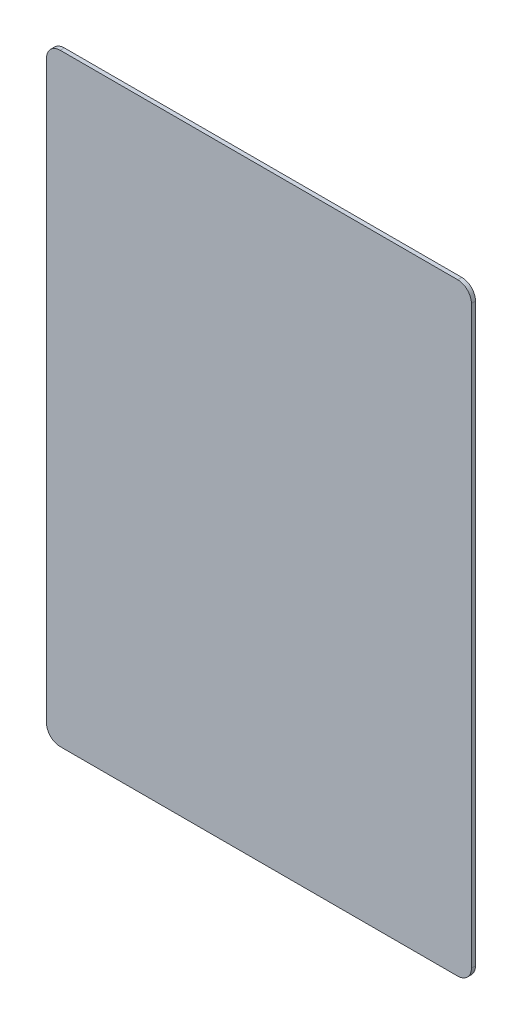
ISO-10303-21;
HEADER;
FILE_DESCRIPTION(('STEP AP214'),'2;1');
FILE_NAME('part.step','',(''),(''),'','','');
FILE_SCHEMA(('AUTOMOTIVE_DESIGN { 1 0 10303 214 1 1 1 1 }'));
ENDSEC;
DATA;
#1=APPLICATION_CONTEXT('core data for automotive mechanical design processes');
#2=APPLICATION_PROTOCOL_DEFINITION('international standard','automotive_design',2000,#1);
#3=PRODUCT_CONTEXT('',#1,'mechanical');
#4=PRODUCT('Part','Part','',(#3));
#5=PRODUCT_RELATED_PRODUCT_CATEGORY('part','',(#4));
#6=PRODUCT_DEFINITION_FORMATION('','',#4);
#7=PRODUCT_DEFINITION_CONTEXT('part definition',#1,'design');
#8=PRODUCT_DEFINITION('design','',#6,#7);
#9=PRODUCT_DEFINITION_SHAPE('','',#8);
#10=(LENGTH_UNIT() NAMED_UNIT(*) SI_UNIT(.MILLI.,.METRE.));
#11=(NAMED_UNIT(*) PLANE_ANGLE_UNIT() SI_UNIT($,.RADIAN.));
#12=(NAMED_UNIT(*) SI_UNIT($,.STERADIAN.) SOLID_ANGLE_UNIT());
#13=UNCERTAINTY_MEASURE_WITH_UNIT(LENGTH_MEASURE(1.E-05),#10,'distance_accuracy_value','');
#14=(GEOMETRIC_REPRESENTATION_CONTEXT(3) GLOBAL_UNCERTAINTY_ASSIGNED_CONTEXT((#13)) GLOBAL_UNIT_ASSIGNED_CONTEXT((#10,
#11,#12)) REPRESENTATION_CONTEXT('',''));
#15=CARTESIAN_POINT('',(0.,0.,0.));
#16=DIRECTION('',(0.,0.,1.));
#17=DIRECTION('',(1.,0.,0.));
#18=AXIS2_PLACEMENT_3D('',#15,#16,#17);
#19=CARTESIAN_POINT('',(0.,440.,3.));
#20=DIRECTION('',(0.,1.,0.));
#21=DIRECTION('',(0.,0.,1.));
#22=AXIS2_PLACEMENT_3D('',#19,#20,#21);
#23=PLANE('',#22);
#24=DIRECTION('',(1.,0.,0.));
#25=VECTOR('',#24,1.);
#26=CARTESIAN_POINT('',(0.,440.,3.));
#27=LINE('',#26,#25);
#28=CARTESIAN_POINT('',(10.,440.,3.));
#29=VERTEX_POINT('',#28);
#30=CARTESIAN_POINT('',(300.,440.,3.));
#31=VERTEX_POINT('',#30);
#32=EDGE_CURVE('E139',#29,#31,#27,.T.);
#33=ORIENTED_EDGE('',*,*,#32,.T.);
#34=DIRECTION('',(0.,0.,-1.));
#35=VECTOR('',#34,1.);
#36=CARTESIAN_POINT('',(300.,440.,0.));
#37=LINE('',#36,#35);
#38=CARTESIAN_POINT('',(300.,440.,0.));
#39=VERTEX_POINT('',#38);
#40=EDGE_CURVE('E11',#31,#39,#37,.T.);
#41=ORIENTED_EDGE('',*,*,#40,.T.);
#42=DIRECTION('',(1.,0.,0.));
#43=VECTOR('',#42,1.);
#44=CARTESIAN_POINT('',(0.,440.,0.));
#45=LINE('',#44,#43);
#46=CARTESIAN_POINT('',(10.,440.,0.));
#47=VERTEX_POINT('',#46);
#48=EDGE_CURVE('E130',#47,#39,#45,.T.);
#49=ORIENTED_EDGE('',*,*,#48,.F.);
#50=DIRECTION('',(0.,0.,-1.));
#51=VECTOR('',#50,1.);
#52=CARTESIAN_POINT('',(10.,440.,3.));
#53=LINE('',#52,#51);
#54=EDGE_CURVE('E43',#47,#29,#53,.F.);
#55=ORIENTED_EDGE('',*,*,#54,.T.);
#56=EDGE_LOOP('',(#33,#41,#49,#55));
#57=FACE_BOUND('',#56,.T.);
#58=ADVANCED_FACE('F35',(#57),#23,.T.);
#59=CARTESIAN_POINT('',(0.,0.,3.));
#60=DIRECTION('',(-1.,0.,0.));
#61=DIRECTION('',(0.,0.,1.));
#62=AXIS2_PLACEMENT_3D('',#59,#60,#61);
#63=PLANE('',#62);
#64=DIRECTION('',(0.,1.,0.));
#65=VECTOR('',#64,1.);
#66=CARTESIAN_POINT('',(0.,0.,0.));
#67=LINE('',#66,#65);
#68=CARTESIAN_POINT('',(0.,10.,0.));
#69=VERTEX_POINT('',#68);
#70=CARTESIAN_POINT('',(0.,430.,0.));
#71=VERTEX_POINT('',#70);
#72=EDGE_CURVE('E132',#69,#71,#67,.T.);
#73=ORIENTED_EDGE('',*,*,#72,.F.);
#74=DIRECTION('',(0.,0.,-1.));
#75=VECTOR('',#74,1.);
#76=CARTESIAN_POINT('',(0.,10.,3.));
#77=LINE('',#76,#75);
#78=CARTESIAN_POINT('',(0.,10.,3.));
#79=VERTEX_POINT('',#78);
#80=EDGE_CURVE('E57',#69,#79,#77,.F.);
#81=ORIENTED_EDGE('',*,*,#80,.T.);
#82=DIRECTION('',(0.,1.,0.));
#83=VECTOR('',#82,1.);
#84=CARTESIAN_POINT('',(0.,0.,3.));
#85=LINE('',#84,#83);
#86=CARTESIAN_POINT('',(0.,430.,3.));
#87=VERTEX_POINT('',#86);
#88=EDGE_CURVE('E140',#79,#87,#85,.T.);
#89=ORIENTED_EDGE('',*,*,#88,.T.);
#90=DIRECTION('',(0.,0.,-1.));
#91=VECTOR('',#90,1.);
#92=CARTESIAN_POINT('',(0.,430.,3.));
#93=LINE('',#92,#91);
#94=EDGE_CURVE('E155',#87,#71,#93,.T.);
#95=ORIENTED_EDGE('',*,*,#94,.T.);
#96=EDGE_LOOP('',(#73,#81,#89,#95));
#97=FACE_BOUND('',#96,.T.);
#98=ADVANCED_FACE('F169',(#97),#63,.T.);
#99=CARTESIAN_POINT('',(0.,0.,3.));
#100=DIRECTION('',(0.,1.,0.));
#101=DIRECTION('',(0.,0.,1.));
#102=AXIS2_PLACEMENT_3D('',#99,#100,#101);
#103=PLANE('',#102);
#104=DIRECTION('',(1.,0.,0.));
#105=VECTOR('',#104,1.);
#106=CARTESIAN_POINT('',(0.,0.,0.));
#107=LINE('',#106,#105);
#108=CARTESIAN_POINT('',(10.,0.,0.));
#109=VERTEX_POINT('',#108);
#110=CARTESIAN_POINT('',(300.,0.,0.));
#111=VERTEX_POINT('',#110);
#112=EDGE_CURVE('E129',#109,#111,#107,.T.);
#113=ORIENTED_EDGE('',*,*,#112,.T.);
#114=DIRECTION('',(0.,0.,-1.));
#115=VECTOR('',#114,1.);
#116=CARTESIAN_POINT('',(300.,0.,3.));
#117=LINE('',#116,#115);
#118=CARTESIAN_POINT('',(300.,0.,3.));
#119=VERTEX_POINT('',#118);
#120=EDGE_CURVE('E107',#111,#119,#117,.F.);
#121=ORIENTED_EDGE('',*,*,#120,.T.);
#122=DIRECTION('',(1.,0.,0.));
#123=VECTOR('',#122,1.);
#124=CARTESIAN_POINT('',(0.,0.,3.));
#125=LINE('',#124,#123);
#126=CARTESIAN_POINT('',(10.,0.,3.));
#127=VERTEX_POINT('',#126);
#128=EDGE_CURVE('E177',#127,#119,#125,.T.);
#129=ORIENTED_EDGE('',*,*,#128,.F.);
#130=DIRECTION('',(0.,0.,-1.));
#131=VECTOR('',#130,1.);
#132=CARTESIAN_POINT('',(10.,0.,0.));
#133=LINE('',#132,#131);
#134=EDGE_CURVE('E112',#127,#109,#133,.T.);
#135=ORIENTED_EDGE('',*,*,#134,.T.);
#136=EDGE_LOOP('',(#113,#121,#129,#135));
#137=FACE_BOUND('',#136,.T.);
#138=ADVANCED_FACE('F176',(#137),#103,.F.);
#139=CARTESIAN_POINT('',(310.,0.,3.));
#140=DIRECTION('',(-1.,0.,0.));
#141=DIRECTION('',(0.,0.,1.));
#142=AXIS2_PLACEMENT_3D('',#139,#140,#141);
#143=PLANE('',#142);
#144=DIRECTION('',(0.,1.,0.));
#145=VECTOR('',#144,1.);
#146=CARTESIAN_POINT('',(310.,0.,3.));
#147=LINE('',#146,#145);
#148=CARTESIAN_POINT('',(310.,10.,3.));
#149=VERTEX_POINT('',#148);
#150=CARTESIAN_POINT('',(310.,430.,3.));
#151=VERTEX_POINT('',#150);
#152=EDGE_CURVE('E122',#149,#151,#147,.T.);
#153=ORIENTED_EDGE('',*,*,#152,.F.);
#154=DIRECTION('',(0.,0.,-1.));
#155=VECTOR('',#154,1.);
#156=CARTESIAN_POINT('',(310.,10.,3.));
#157=LINE('',#156,#155);
#158=CARTESIAN_POINT('',(310.,10.,0.));
#159=VERTEX_POINT('',#158);
#160=EDGE_CURVE('E106',#149,#159,#157,.T.);
#161=ORIENTED_EDGE('',*,*,#160,.T.);
#162=DIRECTION('',(0.,1.,0.));
#163=VECTOR('',#162,1.);
#164=CARTESIAN_POINT('',(310.,0.,0.));
#165=LINE('',#164,#163);
#166=CARTESIAN_POINT('',(310.,430.,0.));
#167=VERTEX_POINT('',#166);
#168=EDGE_CURVE('E119',#159,#167,#165,.T.);
#169=ORIENTED_EDGE('',*,*,#168,.T.);
#170=DIRECTION('',(0.,0.,-1.));
#171=VECTOR('',#170,1.);
#172=CARTESIAN_POINT('',(310.,430.,3.));
#173=LINE('',#172,#171);
#174=EDGE_CURVE('E124',#167,#151,#173,.F.);
#175=ORIENTED_EDGE('',*,*,#174,.T.);
#176=EDGE_LOOP('',(#153,#161,#169,#175));
#177=FACE_BOUND('',#176,.T.);
#178=ADVANCED_FACE('F118',(#177),#143,.F.);
#179=CARTESIAN_POINT('',(0.,0.,3.));
#180=DIRECTION('',(0.,0.,1.));
#181=DIRECTION('',(1.,0.,0.));
#182=AXIS2_PLACEMENT_3D('',#179,#180,#181);
#183=PLANE('',#182);
#184=ORIENTED_EDGE('',*,*,#128,.T.);
#185=CARTESIAN_POINT('',(300.,10.,3.));
#186=DIRECTION('',(0.,0.,1.));
#187=DIRECTION('',(1.,0.,0.));
#188=AXIS2_PLACEMENT_3D('',#185,#186,#187);
#189=CIRCLE('',#188,10.);
#190=EDGE_CURVE('E153',#119,#149,#189,.T.);
#191=ORIENTED_EDGE('',*,*,#190,.T.);
#192=ORIENTED_EDGE('',*,*,#152,.T.);
#193=CARTESIAN_POINT('',(300.,430.,3.));
#194=DIRECTION('',(0.,0.,1.));
#195=DIRECTION('',(1.,0.,0.));
#196=AXIS2_PLACEMENT_3D('',#193,#194,#195);
#197=CIRCLE('',#196,10.);
#198=EDGE_CURVE('E149',#151,#31,#197,.T.);
#199=ORIENTED_EDGE('',*,*,#198,.T.);
#200=ORIENTED_EDGE('',*,*,#32,.F.);
#201=CARTESIAN_POINT('',(10.,430.,3.));
#202=DIRECTION('',(0.,0.,1.));
#203=DIRECTION('',(1.,0.,0.));
#204=AXIS2_PLACEMENT_3D('',#201,#202,#203);
#205=CIRCLE('',#204,10.);
#206=EDGE_CURVE('E50',#29,#87,#205,.T.);
#207=ORIENTED_EDGE('',*,*,#206,.T.);
#208=ORIENTED_EDGE('',*,*,#88,.F.);
#209=CARTESIAN_POINT('',(10.,10.,3.));
#210=DIRECTION('',(0.,0.,1.));
#211=DIRECTION('',(1.,0.,0.));
#212=AXIS2_PLACEMENT_3D('',#209,#210,#211);
#213=CIRCLE('',#212,10.);
#214=EDGE_CURVE('E151',#79,#127,#213,.T.);
#215=ORIENTED_EDGE('',*,*,#214,.T.);
#216=EDGE_LOOP('',(#184,#191,#192,#199,#200,#207,#208,#215));
#217=FACE_BOUND('',#216,.T.);
#218=ADVANCED_FACE('F165',(#217),#183,.T.);
#219=CARTESIAN_POINT('',(0.,0.,0.));
#220=DIRECTION('',(0.,0.,1.));
#221=DIRECTION('',(1.,0.,0.));
#222=AXIS2_PLACEMENT_3D('',#219,#220,#221);
#223=PLANE('',#222);
#224=ORIENTED_EDGE('',*,*,#168,.F.);
#225=CARTESIAN_POINT('',(300.,10.,0.));
#226=DIRECTION('',(0.,0.,1.));
#227=DIRECTION('',(1.,0.,0.));
#228=AXIS2_PLACEMENT_3D('',#225,#226,#227);
#229=CIRCLE('',#228,10.);
#230=EDGE_CURVE('E102',#159,#111,#229,.F.);
#231=ORIENTED_EDGE('',*,*,#230,.T.);
#232=ORIENTED_EDGE('',*,*,#112,.F.);
#233=CARTESIAN_POINT('',(10.,10.,0.));
#234=DIRECTION('',(0.,0.,1.));
#235=DIRECTION('',(1.,0.,0.));
#236=AXIS2_PLACEMENT_3D('',#233,#234,#235);
#237=CIRCLE('',#236,10.);
#238=EDGE_CURVE('E113',#109,#69,#237,.F.);
#239=ORIENTED_EDGE('',*,*,#238,.T.);
#240=ORIENTED_EDGE('',*,*,#72,.T.);
#241=CARTESIAN_POINT('',(10.,430.,0.));
#242=DIRECTION('',(0.,0.,1.));
#243=DIRECTION('',(1.,0.,0.));
#244=AXIS2_PLACEMENT_3D('',#241,#242,#243);
#245=CIRCLE('',#244,10.);
#246=EDGE_CURVE('E123',#71,#47,#245,.F.);
#247=ORIENTED_EDGE('',*,*,#246,.T.);
#248=ORIENTED_EDGE('',*,*,#48,.T.);
#249=CARTESIAN_POINT('',(300.,430.,0.));
#250=DIRECTION('',(0.,0.,1.));
#251=DIRECTION('',(1.,0.,0.));
#252=AXIS2_PLACEMENT_3D('',#249,#250,#251);
#253=CIRCLE('',#252,10.);
#254=EDGE_CURVE('E128',#39,#167,#253,.F.);
#255=ORIENTED_EDGE('',*,*,#254,.T.);
#256=EDGE_LOOP('',(#224,#231,#232,#239,#240,#247,#248,#255));
#257=FACE_BOUND('',#256,.T.);
#258=ADVANCED_FACE('F126',(#257),#223,.F.);
#259=CARTESIAN_POINT('',(300.,10.,3.));
#260=DIRECTION('',(0.,0.,-1.));
#261=DIRECTION('',(-1.,0.,0.));
#262=AXIS2_PLACEMENT_3D('',#259,#260,#261);
#263=CYLINDRICAL_SURFACE('',#262,10.);
#264=ORIENTED_EDGE('',*,*,#190,.F.);
#265=ORIENTED_EDGE('',*,*,#120,.F.);
#266=ORIENTED_EDGE('',*,*,#230,.F.);
#267=ORIENTED_EDGE('',*,*,#160,.F.);
#268=EDGE_LOOP('',(#264,#265,#266,#267));
#269=FACE_BOUND('',#268,.T.);
#270=ADVANCED_FACE('F105',(#269),#263,.T.);
#271=CARTESIAN_POINT('',(10.,10.,3.));
#272=DIRECTION('',(0.,0.,1.));
#273=DIRECTION('',(1.,0.,0.));
#274=AXIS2_PLACEMENT_3D('',#271,#272,#273);
#275=CYLINDRICAL_SURFACE('',#274,10.);
#276=ORIENTED_EDGE('',*,*,#214,.F.);
#277=ORIENTED_EDGE('',*,*,#80,.F.);
#278=ORIENTED_EDGE('',*,*,#238,.F.);
#279=ORIENTED_EDGE('',*,*,#134,.F.);
#280=EDGE_LOOP('',(#276,#277,#278,#279));
#281=FACE_BOUND('',#280,.T.);
#282=ADVANCED_FACE('F173',(#281),#275,.T.);
#283=CARTESIAN_POINT('',(300.,430.,3.));
#284=DIRECTION('',(0.,0.,1.));
#285=DIRECTION('',(1.,0.,0.));
#286=AXIS2_PLACEMENT_3D('',#283,#284,#285);
#287=CYLINDRICAL_SURFACE('',#286,10.);
#288=ORIENTED_EDGE('',*,*,#198,.F.);
#289=ORIENTED_EDGE('',*,*,#174,.F.);
#290=ORIENTED_EDGE('',*,*,#254,.F.);
#291=ORIENTED_EDGE('',*,*,#40,.F.);
#292=EDGE_LOOP('',(#288,#289,#290,#291));
#293=FACE_BOUND('',#292,.T.);
#294=ADVANCED_FACE('F181',(#293),#287,.T.);
#295=CARTESIAN_POINT('',(10.,430.,3.));
#296=DIRECTION('',(0.,0.,-1.));
#297=DIRECTION('',(-1.,0.,0.));
#298=AXIS2_PLACEMENT_3D('',#295,#296,#297);
#299=CYLINDRICAL_SURFACE('',#298,10.);
#300=ORIENTED_EDGE('',*,*,#206,.F.);
#301=ORIENTED_EDGE('',*,*,#54,.F.);
#302=ORIENTED_EDGE('',*,*,#246,.F.);
#303=ORIENTED_EDGE('',*,*,#94,.F.);
#304=EDGE_LOOP('',(#300,#301,#302,#303));
#305=FACE_BOUND('',#304,.T.);
#306=ADVANCED_FACE('F37',(#305),#299,.T.);
#307=CLOSED_SHELL('',(#58,#98,#138,#178,#218,#258,#270,#282,#294,#306));
#308=MANIFOLD_SOLID_BREP('B2',#307);
#309=ADVANCED_BREP_SHAPE_REPRESENTATION('',(#18,#308),#14);
#310=SHAPE_DEFINITION_REPRESENTATION(#9,#309);
ENDSEC;
END-ISO-10303-21;
